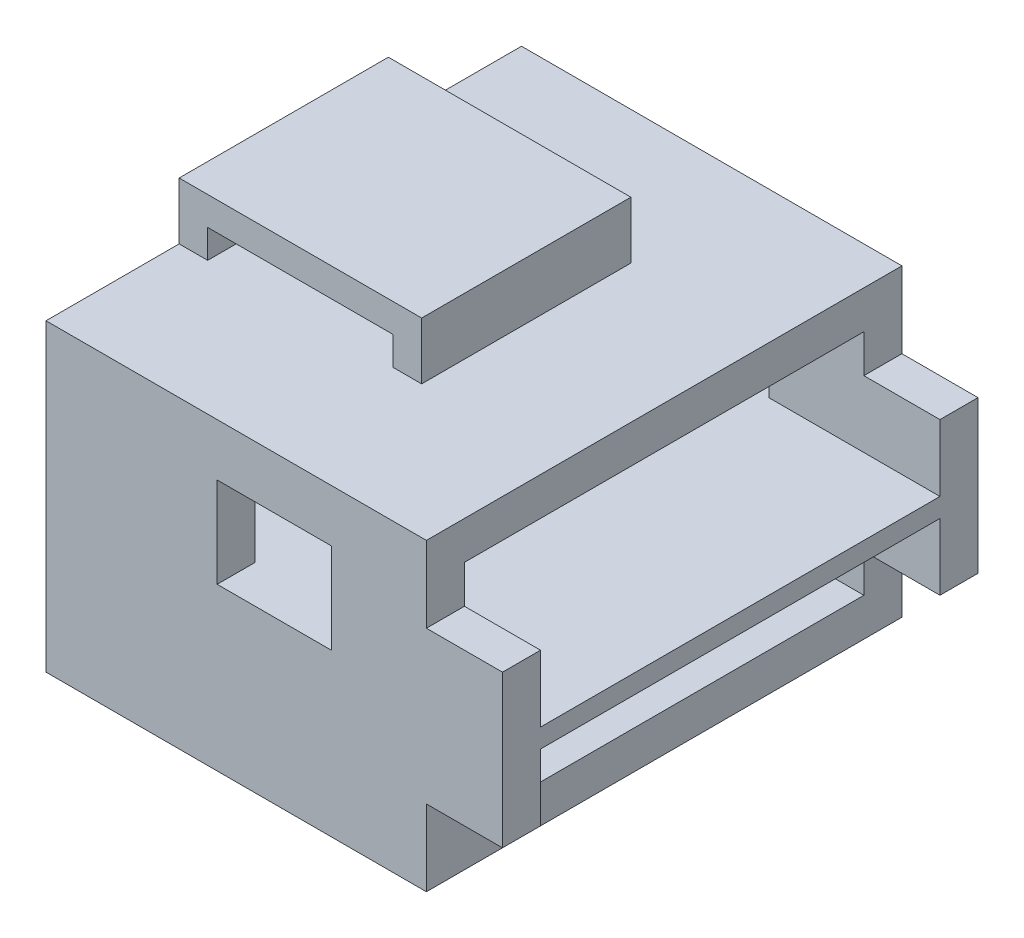
ISO-10303-21;
HEADER;
FILE_DESCRIPTION(('STEP AP214'),'2;1');
FILE_NAME('part.step','',(''),(''),'','','');
FILE_SCHEMA(('AUTOMOTIVE_DESIGN { 1 0 10303 214 1 1 1 1 }'));
ENDSEC;
DATA;
#1=APPLICATION_CONTEXT('core data for automotive mechanical design processes');
#2=APPLICATION_PROTOCOL_DEFINITION('international standard','automotive_design',2000,#1);
#3=PRODUCT_CONTEXT('',#1,'mechanical');
#4=PRODUCT('Part','Part','',(#3));
#5=PRODUCT_RELATED_PRODUCT_CATEGORY('part','',(#4));
#6=PRODUCT_DEFINITION_FORMATION('','',#4);
#7=PRODUCT_DEFINITION_CONTEXT('part definition',#1,'design');
#8=PRODUCT_DEFINITION('design','',#6,#7);
#9=PRODUCT_DEFINITION_SHAPE('','',#8);
#10=(LENGTH_UNIT() NAMED_UNIT(*) SI_UNIT(.MILLI.,.METRE.));
#11=(NAMED_UNIT(*) PLANE_ANGLE_UNIT() SI_UNIT($,.RADIAN.));
#12=(NAMED_UNIT(*) SI_UNIT($,.STERADIAN.) SOLID_ANGLE_UNIT());
#13=UNCERTAINTY_MEASURE_WITH_UNIT(LENGTH_MEASURE(1.E-05),#10,'distance_accuracy_value','');
#14=(GEOMETRIC_REPRESENTATION_CONTEXT(3) GLOBAL_UNCERTAINTY_ASSIGNED_CONTEXT((#13)) GLOBAL_UNIT_ASSIGNED_CONTEXT((#10,
#11,#12)) REPRESENTATION_CONTEXT('',''));
#15=CARTESIAN_POINT('',(0.,0.,0.));
#16=DIRECTION('',(0.,0.,1.));
#17=DIRECTION('',(1.,0.,0.));
#18=AXIS2_PLACEMENT_3D('',#15,#16,#17);
#19=CARTESIAN_POINT('',(0.,16.,0.));
#20=DIRECTION('',(0.,1.,0.));
#21=DIRECTION('',(0.,0.,1.));
#22=AXIS2_PLACEMENT_3D('',#19,#20,#21);
#23=PLANE('',#22);
#24=DIRECTION('',(-1.,0.,0.));
#25=VECTOR('',#24,1.);
#26=CARTESIAN_POINT('',(0.,16.,5.5));
#27=LINE('',#26,#25);
#28=CARTESIAN_POINT('',(2.75,16.,5.5));
#29=VERTEX_POINT('',#28);
#30=CARTESIAN_POINT('',(1.25,16.,5.5));
#31=VERTEX_POINT('',#30);
#32=EDGE_CURVE('E500',#29,#31,#27,.T.);
#33=ORIENTED_EDGE('',*,*,#32,.T.);
#34=DIRECTION('',(0.,0.,1.));
#35=VECTOR('',#34,1.);
#36=CARTESIAN_POINT('',(1.25,16.,-11.5));
#37=LINE('',#36,#35);
#38=CARTESIAN_POINT('',(1.25,16.,-5.5));
#39=VERTEX_POINT('',#38);
#40=EDGE_CURVE('E479',#39,#31,#37,.T.);
#41=ORIENTED_EDGE('',*,*,#40,.F.);
#42=DIRECTION('',(1.,0.,0.));
#43=VECTOR('',#42,1.);
#44=CARTESIAN_POINT('',(0.,16.,-5.5));
#45=LINE('',#44,#43);
#46=CARTESIAN_POINT('',(2.75,16.,-5.5));
#47=VERTEX_POINT('',#46);
#48=EDGE_CURVE('E495',#39,#47,#45,.T.);
#49=ORIENTED_EDGE('',*,*,#48,.T.);
#50=DIRECTION('',(0.,0.,1.));
#51=VECTOR('',#50,1.);
#52=CARTESIAN_POINT('',(2.75,16.,0.));
#53=LINE('',#52,#51);
#54=EDGE_CURVE('E513',#47,#29,#53,.T.);
#55=ORIENTED_EDGE('',*,*,#54,.T.);
#56=EDGE_LOOP('',(#33,#41,#49,#55));
#57=FACE_BOUND('',#56,.T.);
#58=CARTESIAN_POINT('',(-10.,16.,-5.5));
#59=VERTEX_POINT('',#58);
#60=CARTESIAN_POINT('',(-8.5,16.,-5.5));
#61=VERTEX_POINT('',#60);
#62=EDGE_CURVE('E510',#59,#61,#45,.T.);
#63=ORIENTED_EDGE('',*,*,#62,.T.);
#64=DIRECTION('',(0.,0.,1.));
#65=VECTOR('',#64,1.);
#66=CARTESIAN_POINT('',(-8.5,16.,-11.5));
#67=LINE('',#66,#65);
#68=CARTESIAN_POINT('',(-8.5,16.,5.5));
#69=VERTEX_POINT('',#68);
#70=EDGE_CURVE('E482',#61,#69,#67,.T.);
#71=ORIENTED_EDGE('',*,*,#70,.T.);
#72=CARTESIAN_POINT('',(-10.,16.,5.5));
#73=VERTEX_POINT('',#72);
#74=EDGE_CURVE('E516',#69,#73,#27,.T.);
#75=ORIENTED_EDGE('',*,*,#74,.T.);
#76=DIRECTION('',(0.,0.,1.));
#77=VECTOR('',#76,1.);
#78=CARTESIAN_POINT('',(-10.,16.,-12.5));
#79=LINE('',#78,#77);
#80=CARTESIAN_POINT('',(-10.,16.,12.5));
#81=VERTEX_POINT('',#80);
#82=EDGE_CURVE('E364',#73,#81,#79,.T.);
#83=ORIENTED_EDGE('',*,*,#82,.T.);
#84=DIRECTION('',(1.,0.,0.));
#85=VECTOR('',#84,1.);
#86=CARTESIAN_POINT('',(-10.,16.,12.5));
#87=LINE('',#86,#85);
#88=CARTESIAN_POINT('',(10.,16.,12.5));
#89=VERTEX_POINT('',#88);
#90=EDGE_CURVE('E368',#81,#89,#87,.T.);
#91=ORIENTED_EDGE('',*,*,#90,.T.);
#92=DIRECTION('',(0.,0.,-1.));
#93=VECTOR('',#92,1.);
#94=CARTESIAN_POINT('',(10.,16.,-12.5));
#95=LINE('',#94,#93);
#96=CARTESIAN_POINT('',(10.,16.,-12.5));
#97=VERTEX_POINT('',#96);
#98=EDGE_CURVE('E358',#89,#97,#95,.T.);
#99=ORIENTED_EDGE('',*,*,#98,.T.);
#100=DIRECTION('',(-1.,0.,0.));
#101=VECTOR('',#100,1.);
#102=CARTESIAN_POINT('',(-10.,16.,-12.5));
#103=LINE('',#102,#101);
#104=CARTESIAN_POINT('',(-10.,16.,-12.5));
#105=VERTEX_POINT('',#104);
#106=EDGE_CURVE('E361',#97,#105,#103,.T.);
#107=ORIENTED_EDGE('',*,*,#106,.T.);
#108=EDGE_CURVE('E365',#105,#59,#79,.T.);
#109=ORIENTED_EDGE('',*,*,#108,.T.);
#110=EDGE_LOOP('',(#63,#71,#75,#83,#91,#99,#107,#109));
#111=FACE_BOUND('',#110,.T.);
#112=ADVANCED_FACE('F39',(#57,#111),#23,.T.);
#113=CARTESIAN_POINT('',(10.,16.,-12.5));
#114=DIRECTION('',(-1.,0.,0.));
#115=DIRECTION('',(0.,0.,1.));
#116=AXIS2_PLACEMENT_3D('',#113,#114,#115);
#117=PLANE('',#116);
#118=DIRECTION('',(0.,0.,1.));
#119=VECTOR('',#118,1.);
#120=CARTESIAN_POINT('',(10.,12.,-12.5));
#121=LINE('',#120,#119);
#122=CARTESIAN_POINT('',(10.,12.,-12.5));
#123=VERTEX_POINT('',#122);
#124=CARTESIAN_POINT('',(10.,12.,-10.5));
#125=VERTEX_POINT('',#124);
#126=EDGE_CURVE('E521',#123,#125,#121,.T.);
#127=ORIENTED_EDGE('',*,*,#126,.F.);
#128=DIRECTION('',(0.,-1.,0.));
#129=VECTOR('',#128,1.);
#130=CARTESIAN_POINT('',(10.,16.,-12.5));
#131=LINE('',#130,#129);
#132=EDGE_CURVE('E389',#97,#123,#131,.T.);
#133=ORIENTED_EDGE('',*,*,#132,.F.);
#134=ORIENTED_EDGE('',*,*,#98,.F.);
#135=DIRECTION('',(0.,-1.,0.));
#136=VECTOR('',#135,1.);
#137=CARTESIAN_POINT('',(10.,16.,12.5));
#138=LINE('',#137,#136);
#139=CARTESIAN_POINT('',(10.,12.,12.5));
#140=VERTEX_POINT('',#139);
#141=EDGE_CURVE('E379',#89,#140,#138,.T.);
#142=ORIENTED_EDGE('',*,*,#141,.T.);
#143=DIRECTION('',(0.,0.,1.));
#144=VECTOR('',#143,1.);
#145=CARTESIAN_POINT('',(10.,12.,-12.5));
#146=LINE('',#145,#144);
#147=CARTESIAN_POINT('',(10.,12.,10.5));
#148=VERTEX_POINT('',#147);
#149=EDGE_CURVE('E552',#148,#140,#146,.T.);
#150=ORIENTED_EDGE('',*,*,#149,.F.);
#151=DIRECTION('',(0.,-1.,0.));
#152=VECTOR('',#151,1.);
#153=CARTESIAN_POINT('',(10.,16.,10.5));
#154=LINE('',#153,#152);
#155=CARTESIAN_POINT('',(10.,14.,10.5));
#156=VERTEX_POINT('',#155);
#157=EDGE_CURVE('E319',#156,#148,#154,.T.);
#158=ORIENTED_EDGE('',*,*,#157,.F.);
#159=DIRECTION('',(0.,0.,1.));
#160=VECTOR('',#159,1.);
#161=CARTESIAN_POINT('',(10.,14.,-12.5));
#162=LINE('',#161,#160);
#163=CARTESIAN_POINT('',(10.,14.,-10.5));
#164=VERTEX_POINT('',#163);
#165=EDGE_CURVE('E345',#164,#156,#162,.T.);
#166=ORIENTED_EDGE('',*,*,#165,.F.);
#167=DIRECTION('',(0.,1.,0.));
#168=VECTOR('',#167,1.);
#169=CARTESIAN_POINT('',(10.,16.,-10.5));
#170=LINE('',#169,#168);
#171=EDGE_CURVE('E341',#125,#164,#170,.T.);
#172=ORIENTED_EDGE('',*,*,#171,.F.);
#173=EDGE_LOOP('',(#127,#133,#134,#142,#150,#158,#166,#172));
#174=FACE_BOUND('',#173,.T.);
#175=ADVANCED_FACE('F41',(#174),#117,.F.);
#176=DIRECTION('',(0.,0.,-1.));
#177=VECTOR('',#176,1.);
#178=CARTESIAN_POINT('',(10.,4.,-12.5));
#179=LINE('',#178,#177);
#180=CARTESIAN_POINT('',(10.,4.,-10.5));
#181=VERTEX_POINT('',#180);
#182=CARTESIAN_POINT('',(10.,4.,-12.5));
#183=VERTEX_POINT('',#182);
#184=EDGE_CURVE('E533',#181,#183,#179,.T.);
#185=ORIENTED_EDGE('',*,*,#184,.F.);
#186=CARTESIAN_POINT('',(10.,2.,-10.5));
#187=VERTEX_POINT('',#186);
#188=EDGE_CURVE('E342',#187,#181,#170,.T.);
#189=ORIENTED_EDGE('',*,*,#188,.F.);
#190=DIRECTION('',(0.,0.,-1.));
#191=VECTOR('',#190,1.);
#192=CARTESIAN_POINT('',(10.,2.,-12.5));
#193=LINE('',#192,#191);
#194=CARTESIAN_POINT('',(10.,2.,10.5));
#195=VERTEX_POINT('',#194);
#196=EDGE_CURVE('E339',#195,#187,#193,.T.);
#197=ORIENTED_EDGE('',*,*,#196,.F.);
#198=CARTESIAN_POINT('',(10.,4.,10.5));
#199=VERTEX_POINT('',#198);
#200=EDGE_CURVE('E324',#199,#195,#154,.T.);
#201=ORIENTED_EDGE('',*,*,#200,.F.);
#202=DIRECTION('',(0.,0.,-1.));
#203=VECTOR('',#202,1.);
#204=CARTESIAN_POINT('',(10.,4.,-12.5));
#205=LINE('',#204,#203);
#206=CARTESIAN_POINT('',(10.,4.,12.5));
#207=VERTEX_POINT('',#206);
#208=EDGE_CURVE('E564',#207,#199,#205,.T.);
#209=ORIENTED_EDGE('',*,*,#208,.F.);
#210=CARTESIAN_POINT('',(10.,0.,12.5));
#211=VERTEX_POINT('',#210);
#212=EDGE_CURVE('E370',#207,#211,#138,.T.);
#213=ORIENTED_EDGE('',*,*,#212,.T.);
#214=DIRECTION('',(0.,0.,-1.));
#215=VECTOR('',#214,1.);
#216=CARTESIAN_POINT('',(10.,0.,-12.5));
#217=LINE('',#216,#215);
#218=CARTESIAN_POINT('',(10.,0.,-12.5));
#219=VERTEX_POINT('',#218);
#220=EDGE_CURVE('E351',#211,#219,#217,.T.);
#221=ORIENTED_EDGE('',*,*,#220,.T.);
#222=EDGE_CURVE('E388',#183,#219,#131,.T.);
#223=ORIENTED_EDGE('',*,*,#222,.F.);
#224=EDGE_LOOP('',(#185,#189,#197,#201,#209,#213,#221,#223));
#225=FACE_BOUND('',#224,.T.);
#226=ADVANCED_FACE('F664',(#225),#117,.F.);
#227=CARTESIAN_POINT('',(-7.99999999999999,16.,10.5));
#228=DIRECTION('',(0.,0.,1.));
#229=DIRECTION('',(0.,-1.,0.));
#230=AXIS2_PLACEMENT_3D('',#227,#228,#229);
#231=PLANE('',#230);
#232=DIRECTION('',(0.,-1.,0.));
#233=VECTOR('',#232,1.);
#234=CARTESIAN_POINT('',(-7.99999999999999,16.,10.5));
#235=LINE('',#234,#233);
#236=CARTESIAN_POINT('',(-7.99999999999999,7.5,10.5));
#237=VERTEX_POINT('',#236);
#238=CARTESIAN_POINT('',(-7.99999999999999,2.,10.5));
#239=VERTEX_POINT('',#238);
#240=EDGE_CURVE('E335',#237,#239,#235,.T.);
#241=ORIENTED_EDGE('',*,*,#240,.F.);
#242=DIRECTION('',(-1.,0.,0.));
#243=VECTOR('',#242,1.);
#244=CARTESIAN_POINT('',(14.,7.5,10.5));
#245=LINE('',#244,#243);
#246=CARTESIAN_POINT('',(14.,7.5,10.5));
#247=VERTEX_POINT('',#246);
#248=EDGE_CURVE('E581',#247,#237,#245,.T.);
#249=ORIENTED_EDGE('',*,*,#248,.F.);
#250=DIRECTION('',(0.,1.,0.));
#251=VECTOR('',#250,1.);
#252=CARTESIAN_POINT('',(14.,16.,10.5));
#253=LINE('',#252,#251);
#254=CARTESIAN_POINT('',(14.,4.,10.5));
#255=VERTEX_POINT('',#254);
#256=EDGE_CURVE('E553',#255,#247,#253,.T.);
#257=ORIENTED_EDGE('',*,*,#256,.F.);
#258=DIRECTION('',(-1.,0.,0.));
#259=VECTOR('',#258,1.);
#260=CARTESIAN_POINT('',(14.,4.,10.5));
#261=LINE('',#260,#259);
#262=EDGE_CURVE('E562',#255,#199,#261,.T.);
#263=ORIENTED_EDGE('',*,*,#262,.T.);
#264=ORIENTED_EDGE('',*,*,#200,.T.);
#265=DIRECTION('',(1.,0.,0.));
#266=VECTOR('',#265,1.);
#267=CARTESIAN_POINT('',(-7.99999999999999,2.,10.5));
#268=LINE('',#267,#266);
#269=EDGE_CURVE('E348',#239,#195,#268,.T.);
#270=ORIENTED_EDGE('',*,*,#269,.F.);
#271=EDGE_LOOP('',(#241,#249,#257,#263,#264,#270));
#272=FACE_BOUND('',#271,.T.);
#273=ADVANCED_FACE('F690',(#272),#231,.F.);
#274=DIRECTION('',(-1.,0.,0.));
#275=VECTOR('',#274,1.);
#276=CARTESIAN_POINT('',(14.,8.5,10.5));
#277=LINE('',#276,#275);
#278=CARTESIAN_POINT('',(14.,8.5,10.5));
#279=VERTEX_POINT('',#278);
#280=CARTESIAN_POINT('',(5.,8.5,10.5));
#281=VERTEX_POINT('',#280);
#282=EDGE_CURVE('E584',#279,#281,#277,.T.);
#283=ORIENTED_EDGE('',*,*,#282,.T.);
#284=DIRECTION('',(0.,1.,0.));
#285=VECTOR('',#284,1.);
#286=CARTESIAN_POINT('',(5.,16.,10.5));
#287=LINE('',#286,#285);
#288=CARTESIAN_POINT('',(5.,13.25,10.5));
#289=VERTEX_POINT('',#288);
#290=EDGE_CURVE('E463',#281,#289,#287,.T.);
#291=ORIENTED_EDGE('',*,*,#290,.T.);
#292=DIRECTION('',(-1.,0.,0.));
#293=VECTOR('',#292,1.);
#294=CARTESIAN_POINT('',(-7.99999999999999,13.25,10.5));
#295=LINE('',#294,#293);
#296=CARTESIAN_POINT('',(-0.999999999999997,13.25,10.5));
#297=VERTEX_POINT('',#296);
#298=EDGE_CURVE('E472',#289,#297,#295,.T.);
#299=ORIENTED_EDGE('',*,*,#298,.T.);
#300=DIRECTION('',(0.,-1.,0.));
#301=VECTOR('',#300,1.);
#302=CARTESIAN_POINT('',(-0.999999999999997,16.,10.5));
#303=LINE('',#302,#301);
#304=CARTESIAN_POINT('',(-0.999999999999997,8.5,10.5));
#305=VERTEX_POINT('',#304);
#306=EDGE_CURVE('E451',#297,#305,#303,.T.);
#307=ORIENTED_EDGE('',*,*,#306,.T.);
#308=CARTESIAN_POINT('',(-7.99999999999999,8.5,10.5));
#309=VERTEX_POINT('',#308);
#310=EDGE_CURVE('E583',#305,#309,#277,.T.);
#311=ORIENTED_EDGE('',*,*,#310,.T.);
#312=CARTESIAN_POINT('',(-7.99999999999999,14.,10.5));
#313=VERTEX_POINT('',#312);
#314=EDGE_CURVE('E336',#313,#309,#235,.T.);
#315=ORIENTED_EDGE('',*,*,#314,.F.);
#316=DIRECTION('',(1.,0.,0.));
#317=VECTOR('',#316,1.);
#318=CARTESIAN_POINT('',(-7.99999999999999,14.,10.5));
#319=LINE('',#318,#317);
#320=EDGE_CURVE('E352',#313,#156,#319,.T.);
#321=ORIENTED_EDGE('',*,*,#320,.T.);
#322=ORIENTED_EDGE('',*,*,#157,.T.);
#323=DIRECTION('',(-1.,0.,0.));
#324=VECTOR('',#323,1.);
#325=CARTESIAN_POINT('',(14.,12.,10.5));
#326=LINE('',#325,#324);
#327=CARTESIAN_POINT('',(14.,12.,10.5));
#328=VERTEX_POINT('',#327);
#329=EDGE_CURVE('E573',#328,#148,#326,.T.);
#330=ORIENTED_EDGE('',*,*,#329,.F.);
#331=EDGE_CURVE('E556',#279,#328,#253,.T.);
#332=ORIENTED_EDGE('',*,*,#331,.F.);
#333=EDGE_LOOP('',(#283,#291,#299,#307,#311,#315,#321,#322,#330,#332));
#334=FACE_BOUND('',#333,.T.);
#335=ADVANCED_FACE('F612',(#334),#231,.F.);
#336=CARTESIAN_POINT('',(-8.,16.,-10.5));
#337=DIRECTION('',(0.,0.,-1.));
#338=DIRECTION('',(0.,1.,0.));
#339=AXIS2_PLACEMENT_3D('',#336,#337,#338);
#340=PLANE('',#339);
#341=DIRECTION('',(-1.,0.,0.));
#342=VECTOR('',#341,1.);
#343=CARTESIAN_POINT('',(14.,7.5,-10.5));
#344=LINE('',#343,#342);
#345=CARTESIAN_POINT('',(14.,7.5,-10.5));
#346=VERTEX_POINT('',#345);
#347=CARTESIAN_POINT('',(-8.,7.5,-10.5));
#348=VERTEX_POINT('',#347);
#349=EDGE_CURVE('E328',#346,#348,#344,.T.);
#350=ORIENTED_EDGE('',*,*,#349,.T.);
#351=DIRECTION('',(0.,1.,0.));
#352=VECTOR('',#351,1.);
#353=CARTESIAN_POINT('',(-8.,16.,-10.5));
#354=LINE('',#353,#352);
#355=CARTESIAN_POINT('',(-8.,2.,-10.5));
#356=VERTEX_POINT('',#355);
#357=EDGE_CURVE('E330',#356,#348,#354,.T.);
#358=ORIENTED_EDGE('',*,*,#357,.F.);
#359=DIRECTION('',(1.,0.,0.));
#360=VECTOR('',#359,1.);
#361=CARTESIAN_POINT('',(-8.,2.,-10.5));
#362=LINE('',#361,#360);
#363=EDGE_CURVE('E316',#356,#187,#362,.T.);
#364=ORIENTED_EDGE('',*,*,#363,.T.);
#365=ORIENTED_EDGE('',*,*,#188,.T.);
#366=DIRECTION('',(-1.,0.,0.));
#367=VECTOR('',#366,1.);
#368=CARTESIAN_POINT('',(14.,4.,-10.5));
#369=LINE('',#368,#367);
#370=CARTESIAN_POINT('',(14.,4.,-10.5));
#371=VERTEX_POINT('',#370);
#372=EDGE_CURVE('E545',#371,#181,#369,.T.);
#373=ORIENTED_EDGE('',*,*,#372,.F.);
#374=DIRECTION('',(0.,-1.,0.));
#375=VECTOR('',#374,1.);
#376=CARTESIAN_POINT('',(14.,16.,-10.5));
#377=LINE('',#376,#375);
#378=EDGE_CURVE('E535',#346,#371,#377,.T.);
#379=ORIENTED_EDGE('',*,*,#378,.F.);
#380=EDGE_LOOP('',(#350,#358,#364,#365,#373,#379));
#381=FACE_BOUND('',#380,.T.);
#382=ADVANCED_FACE('F695',(#381),#340,.F.);
#383=DIRECTION('',(1.,0.,0.));
#384=VECTOR('',#383,1.);
#385=CARTESIAN_POINT('',(-8.,13.25,-10.5));
#386=LINE('',#385,#384);
#387=CARTESIAN_POINT('',(-0.999999999999997,13.25,-10.5));
#388=VERTEX_POINT('',#387);
#389=CARTESIAN_POINT('',(5.,13.25,-10.5));
#390=VERTEX_POINT('',#389);
#391=EDGE_CURVE('E469',#388,#390,#386,.T.);
#392=ORIENTED_EDGE('',*,*,#391,.T.);
#393=DIRECTION('',(0.,-1.,0.));
#394=VECTOR('',#393,1.);
#395=CARTESIAN_POINT('',(5.,16.,-10.5));
#396=LINE('',#395,#394);
#397=CARTESIAN_POINT('',(5.,8.5,-10.5));
#398=VERTEX_POINT('',#397);
#399=EDGE_CURVE('E460',#390,#398,#396,.T.);
#400=ORIENTED_EDGE('',*,*,#399,.T.);
#401=DIRECTION('',(-1.,0.,0.));
#402=VECTOR('',#401,1.);
#403=CARTESIAN_POINT('',(14.,8.5,-10.5));
#404=LINE('',#403,#402);
#405=CARTESIAN_POINT('',(14.,8.5,-10.5));
#406=VERTEX_POINT('',#405);
#407=EDGE_CURVE('E587',#406,#398,#404,.T.);
#408=ORIENTED_EDGE('',*,*,#407,.F.);
#409=CARTESIAN_POINT('',(14.,12.,-10.5));
#410=VERTEX_POINT('',#409);
#411=EDGE_CURVE('E536',#410,#406,#377,.T.);
#412=ORIENTED_EDGE('',*,*,#411,.F.);
#413=DIRECTION('',(-1.,0.,0.));
#414=VECTOR('',#413,1.);
#415=CARTESIAN_POINT('',(14.,12.,-10.5));
#416=LINE('',#415,#414);
#417=EDGE_CURVE('E547',#410,#125,#416,.T.);
#418=ORIENTED_EDGE('',*,*,#417,.T.);
#419=ORIENTED_EDGE('',*,*,#171,.T.);
#420=DIRECTION('',(1.,0.,0.));
#421=VECTOR('',#420,1.);
#422=CARTESIAN_POINT('',(-8.,14.,-10.5));
#423=LINE('',#422,#421);
#424=CARTESIAN_POINT('',(-8.,14.,-10.5));
#425=VERTEX_POINT('',#424);
#426=EDGE_CURVE('E354',#425,#164,#423,.T.);
#427=ORIENTED_EDGE('',*,*,#426,.F.);
#428=CARTESIAN_POINT('',(-8.,8.5,-10.5));
#429=VERTEX_POINT('',#428);
#430=EDGE_CURVE('E322',#429,#425,#354,.T.);
#431=ORIENTED_EDGE('',*,*,#430,.F.);
#432=CARTESIAN_POINT('',(-0.999999999999997,8.5,-10.5));
#433=VERTEX_POINT('',#432);
#434=EDGE_CURVE('E586',#433,#429,#404,.T.);
#435=ORIENTED_EDGE('',*,*,#434,.F.);
#436=DIRECTION('',(0.,1.,0.));
#437=VECTOR('',#436,1.);
#438=CARTESIAN_POINT('',(-0.999999999999997,16.,-10.5));
#439=LINE('',#438,#437);
#440=EDGE_CURVE('E448',#433,#388,#439,.T.);
#441=ORIENTED_EDGE('',*,*,#440,.T.);
#442=EDGE_LOOP('',(#392,#400,#408,#412,#418,#419,#427,#431,#435,#441));
#443=FACE_BOUND('',#442,.T.);
#444=ADVANCED_FACE('F605',(#443),#340,.F.);
#445=CARTESIAN_POINT('',(-8.,0.,0.));
#446=DIRECTION('',(1.,0.,0.));
#447=DIRECTION('',(0.,0.,-1.));
#448=AXIS2_PLACEMENT_3D('',#445,#446,#447);
#449=PLANE('',#448);
#450=DIRECTION('',(0.,-1.,0.));
#451=VECTOR('',#450,1.);
#452=CARTESIAN_POINT('',(-8.,0.,3.));
#453=LINE('',#452,#451);
#454=CARTESIAN_POINT('',(-8.,6.75,3.));
#455=VERTEX_POINT('',#454);
#456=CARTESIAN_POINT('',(-8.,2.,3.));
#457=VERTEX_POINT('',#456);
#458=EDGE_CURVE('E418',#455,#457,#453,.T.);
#459=ORIENTED_EDGE('',*,*,#458,.F.);
#460=DIRECTION('',(0.,0.,1.));
#461=VECTOR('',#460,1.);
#462=CARTESIAN_POINT('',(-8.,6.75,0.));
#463=LINE('',#462,#461);
#464=CARTESIAN_POINT('',(-8.,6.75,-3.));
#465=VERTEX_POINT('',#464);
#466=EDGE_CURVE('E311',#465,#455,#463,.T.);
#467=ORIENTED_EDGE('',*,*,#466,.F.);
#468=DIRECTION('',(0.,1.,0.));
#469=VECTOR('',#468,1.);
#470=CARTESIAN_POINT('',(-8.,0.,-3.));
#471=LINE('',#470,#469);
#472=CARTESIAN_POINT('',(-8.,2.,-3.));
#473=VERTEX_POINT('',#472);
#474=EDGE_CURVE('E297',#473,#465,#471,.T.);
#475=ORIENTED_EDGE('',*,*,#474,.F.);
#476=DIRECTION('',(0.,0.,-1.));
#477=VECTOR('',#476,1.);
#478=CARTESIAN_POINT('',(-8.,2.,-12.5));
#479=LINE('',#478,#477);
#480=EDGE_CURVE('E309',#473,#356,#479,.T.);
#481=ORIENTED_EDGE('',*,*,#480,.T.);
#482=ORIENTED_EDGE('',*,*,#357,.T.);
#483=DIRECTION('',(0.,0.,1.));
#484=VECTOR('',#483,1.);
#485=CARTESIAN_POINT('',(-8.,7.5,0.));
#486=LINE('',#485,#484);
#487=EDGE_CURVE('E395',#348,#237,#486,.T.);
#488=ORIENTED_EDGE('',*,*,#487,.T.);
#489=ORIENTED_EDGE('',*,*,#240,.T.);
#490=EDGE_CURVE('E318',#239,#457,#479,.T.);
#491=ORIENTED_EDGE('',*,*,#490,.T.);
#492=EDGE_LOOP('',(#459,#467,#475,#481,#482,#488,#489,#491));
#493=FACE_BOUND('',#492,.T.);
#494=ADVANCED_FACE('F307',(#493),#449,.T.);
#495=ORIENTED_EDGE('',*,*,#314,.T.);
#496=DIRECTION('',(0.,0.,-1.));
#497=VECTOR('',#496,1.);
#498=CARTESIAN_POINT('',(-8.,8.5,0.));
#499=LINE('',#498,#497);
#500=EDGE_CURVE('E392',#309,#429,#499,.T.);
#501=ORIENTED_EDGE('',*,*,#500,.T.);
#502=ORIENTED_EDGE('',*,*,#430,.T.);
#503=DIRECTION('',(0.,0.,1.));
#504=VECTOR('',#503,1.);
#505=CARTESIAN_POINT('',(-8.,14.,-12.5));
#506=LINE('',#505,#504);
#507=EDGE_CURVE('E332',#425,#313,#506,.T.);
#508=ORIENTED_EDGE('',*,*,#507,.T.);
#509=EDGE_LOOP('',(#495,#501,#502,#508));
#510=FACE_BOUND('',#509,.T.);
#511=ADVANCED_FACE('F602',(#510),#449,.T.);
#512=CARTESIAN_POINT('',(-10.,16.,-12.5));
#513=DIRECTION('',(0.,0.,1.));
#514=DIRECTION('',(1.,0.,0.));
#515=AXIS2_PLACEMENT_3D('',#512,#513,#514);
#516=PLANE('',#515);
#517=DIRECTION('',(1.,0.,0.));
#518=VECTOR('',#517,1.);
#519=CARTESIAN_POINT('',(-10.,8.5,-12.5));
#520=LINE('',#519,#518);
#521=CARTESIAN_POINT('',(-0.999999999999997,8.5,-12.5));
#522=VERTEX_POINT('',#521);
#523=CARTESIAN_POINT('',(5.,8.5,-12.5));
#524=VERTEX_POINT('',#523);
#525=EDGE_CURVE('E475',#522,#524,#520,.T.);
#526=ORIENTED_EDGE('',*,*,#525,.T.);
#527=DIRECTION('',(0.,1.,0.));
#528=VECTOR('',#527,1.);
#529=CARTESIAN_POINT('',(5.,16.,-12.5));
#530=LINE('',#529,#528);
#531=CARTESIAN_POINT('',(5.,13.25,-12.5));
#532=VERTEX_POINT('',#531);
#533=EDGE_CURVE('E457',#524,#532,#530,.T.);
#534=ORIENTED_EDGE('',*,*,#533,.T.);
#535=DIRECTION('',(-1.,0.,0.));
#536=VECTOR('',#535,1.);
#537=CARTESIAN_POINT('',(-10.,13.25,-12.5));
#538=LINE('',#537,#536);
#539=CARTESIAN_POINT('',(-0.999999999999997,13.25,-12.5));
#540=VERTEX_POINT('',#539);
#541=EDGE_CURVE('E466',#532,#540,#538,.T.);
#542=ORIENTED_EDGE('',*,*,#541,.T.);
#543=DIRECTION('',(0.,-1.,0.));
#544=VECTOR('',#543,1.);
#545=CARTESIAN_POINT('',(-0.999999999999997,16.,-12.5));
#546=LINE('',#545,#544);
#547=EDGE_CURVE('E445',#540,#522,#546,.T.);
#548=ORIENTED_EDGE('',*,*,#547,.T.);
#549=EDGE_LOOP('',(#526,#534,#542,#548));
#550=FACE_BOUND('',#549,.T.);
#551=DIRECTION('',(-1.,0.,0.));
#552=VECTOR('',#551,1.);
#553=CARTESIAN_POINT('',(-10.,0.,-12.5));
#554=LINE('',#553,#552);
#555=CARTESIAN_POINT('',(-10.,0.,-12.5));
#556=VERTEX_POINT('',#555);
#557=EDGE_CURVE('E373',#219,#556,#554,.T.);
#558=ORIENTED_EDGE('',*,*,#557,.T.);
#559=DIRECTION('',(0.,-1.,0.));
#560=VECTOR('',#559,1.);
#561=CARTESIAN_POINT('',(-10.,16.,-12.5));
#562=LINE('',#561,#560);
#563=EDGE_CURVE('E385',#105,#556,#562,.T.);
#564=ORIENTED_EDGE('',*,*,#563,.F.);
#565=ORIENTED_EDGE('',*,*,#106,.F.);
#566=ORIENTED_EDGE('',*,*,#132,.T.);
#567=DIRECTION('',(-1.,0.,0.));
#568=VECTOR('',#567,1.);
#569=CARTESIAN_POINT('',(14.,12.,-12.5));
#570=LINE('',#569,#568);
#571=CARTESIAN_POINT('',(14.,12.,-12.5));
#572=VERTEX_POINT('',#571);
#573=EDGE_CURVE('E550',#572,#123,#570,.T.);
#574=ORIENTED_EDGE('',*,*,#573,.F.);
#575=DIRECTION('',(0.,1.,0.));
#576=VECTOR('',#575,1.);
#577=CARTESIAN_POINT('',(14.,16.,-12.5));
#578=LINE('',#577,#576);
#579=CARTESIAN_POINT('',(14.,4.,-12.5));
#580=VERTEX_POINT('',#579);
#581=EDGE_CURVE('E529',#580,#572,#578,.T.);
#582=ORIENTED_EDGE('',*,*,#581,.F.);
#583=DIRECTION('',(-1.,0.,0.));
#584=VECTOR('',#583,1.);
#585=CARTESIAN_POINT('',(14.,4.,-12.5));
#586=LINE('',#585,#584);
#587=EDGE_CURVE('E540',#580,#183,#586,.T.);
#588=ORIENTED_EDGE('',*,*,#587,.T.);
#589=ORIENTED_EDGE('',*,*,#222,.T.);
#590=EDGE_LOOP('',(#558,#564,#565,#566,#574,#582,#588,#589));
#591=FACE_BOUND('',#590,.T.);
#592=ADVANCED_FACE('F635',(#550,#591),#516,.F.);
#593=CARTESIAN_POINT('',(-10.,16.,-12.5));
#594=DIRECTION('',(1.,0.,0.));
#595=DIRECTION('',(0.,0.,-1.));
#596=AXIS2_PLACEMENT_3D('',#593,#594,#595);
#597=PLANE('',#596);
#598=DIRECTION('',(0.,0.,1.));
#599=VECTOR('',#598,1.);
#600=CARTESIAN_POINT('',(-10.,6.75,-12.5));
#601=LINE('',#600,#599);
#602=CARTESIAN_POINT('',(-10.,6.75,-3.));
#603=VERTEX_POINT('',#602);
#604=CARTESIAN_POINT('',(-10.,6.75,3.));
#605=VERTEX_POINT('',#604);
#606=EDGE_CURVE('E11',#603,#605,#601,.T.);
#607=ORIENTED_EDGE('',*,*,#606,.T.);
#608=DIRECTION('',(0.,-1.,0.));
#609=VECTOR('',#608,1.);
#610=CARTESIAN_POINT('',(-10.,16.,3.00000000000001));
#611=LINE('',#610,#609);
#612=CARTESIAN_POINT('',(-10.,2.,3.));
#613=VERTEX_POINT('',#612);
#614=EDGE_CURVE('E312',#605,#613,#611,.T.);
#615=ORIENTED_EDGE('',*,*,#614,.T.);
#616=DIRECTION('',(0.,0.,-1.));
#617=VECTOR('',#616,1.);
#618=CARTESIAN_POINT('',(-10.,2.,-12.5));
#619=LINE('',#618,#617);
#620=CARTESIAN_POINT('',(-10.,2.,-3.));
#621=VERTEX_POINT('',#620);
#622=EDGE_CURVE('E47',#613,#621,#619,.T.);
#623=ORIENTED_EDGE('',*,*,#622,.T.);
#624=DIRECTION('',(0.,1.,0.));
#625=VECTOR('',#624,1.);
#626=CARTESIAN_POINT('',(-10.,16.,-2.99999999999999));
#627=LINE('',#626,#625);
#628=EDGE_CURVE('E300',#621,#603,#627,.T.);
#629=ORIENTED_EDGE('',*,*,#628,.T.);
#630=EDGE_LOOP('',(#607,#615,#623,#629));
#631=FACE_BOUND('',#630,.T.);
#632=DIRECTION('',(0.,0.,1.));
#633=VECTOR('',#632,1.);
#634=CARTESIAN_POINT('',(-10.,0.,-12.5));
#635=LINE('',#634,#633);
#636=CARTESIAN_POINT('',(-10.,0.,12.5));
#637=VERTEX_POINT('',#636);
#638=EDGE_CURVE('E375',#556,#637,#635,.T.);
#639=ORIENTED_EDGE('',*,*,#638,.T.);
#640=DIRECTION('',(0.,-1.,0.));
#641=VECTOR('',#640,1.);
#642=CARTESIAN_POINT('',(-10.,16.,12.5));
#643=LINE('',#642,#641);
#644=EDGE_CURVE('E382',#81,#637,#643,.T.);
#645=ORIENTED_EDGE('',*,*,#644,.F.);
#646=ORIENTED_EDGE('',*,*,#82,.F.);
#647=DIRECTION('',(0.,-1.,0.));
#648=VECTOR('',#647,1.);
#649=CARTESIAN_POINT('',(-10.,19.,5.5));
#650=LINE('',#649,#648);
#651=CARTESIAN_POINT('',(-10.,19.,5.5));
#652=VERTEX_POINT('',#651);
#653=EDGE_CURVE('E522',#652,#73,#650,.T.);
#654=ORIENTED_EDGE('',*,*,#653,.F.);
#655=DIRECTION('',(0.,0.,-1.));
#656=VECTOR('',#655,1.);
#657=CARTESIAN_POINT('',(-10.,19.,0.));
#658=LINE('',#657,#656);
#659=CARTESIAN_POINT('',(-10.,19.,-5.5));
#660=VERTEX_POINT('',#659);
#661=EDGE_CURVE('E506',#652,#660,#658,.T.);
#662=ORIENTED_EDGE('',*,*,#661,.T.);
#663=DIRECTION('',(0.,-1.,0.));
#664=VECTOR('',#663,1.);
#665=CARTESIAN_POINT('',(-10.,19.,-5.5));
#666=LINE('',#665,#664);
#667=EDGE_CURVE('E519',#660,#59,#666,.T.);
#668=ORIENTED_EDGE('',*,*,#667,.T.);
#669=ORIENTED_EDGE('',*,*,#108,.F.);
#670=ORIENTED_EDGE('',*,*,#563,.T.);
#671=EDGE_LOOP('',(#639,#645,#646,#654,#662,#668,#669,#670));
#672=FACE_BOUND('',#671,.T.);
#673=ADVANCED_FACE('F412',(#631,#672),#597,.F.);
#674=CARTESIAN_POINT('',(-10.,16.,12.5));
#675=DIRECTION('',(0.,0.,-1.));
#676=DIRECTION('',(-1.,0.,0.));
#677=AXIS2_PLACEMENT_3D('',#674,#675,#676);
#678=PLANE('',#677);
#679=DIRECTION('',(1.,0.,0.));
#680=VECTOR('',#679,1.);
#681=CARTESIAN_POINT('',(-10.,13.25,12.5));
#682=LINE('',#681,#680);
#683=CARTESIAN_POINT('',(-0.999999999999997,13.25,12.5));
#684=VERTEX_POINT('',#683);
#685=CARTESIAN_POINT('',(5.,13.25,12.5));
#686=VERTEX_POINT('',#685);
#687=EDGE_CURVE('E405',#684,#686,#682,.T.);
#688=ORIENTED_EDGE('',*,*,#687,.T.);
#689=DIRECTION('',(0.,-1.,0.));
#690=VECTOR('',#689,1.);
#691=CARTESIAN_POINT('',(5.,16.,12.5));
#692=LINE('',#691,#690);
#693=CARTESIAN_POINT('',(5.,8.5,12.5));
#694=VERTEX_POINT('',#693);
#695=EDGE_CURVE('E454',#686,#694,#692,.T.);
#696=ORIENTED_EDGE('',*,*,#695,.T.);
#697=DIRECTION('',(-1.,0.,0.));
#698=VECTOR('',#697,1.);
#699=CARTESIAN_POINT('',(-10.,8.5,12.5));
#700=LINE('',#699,#698);
#701=CARTESIAN_POINT('',(-0.999999999999997,8.5,12.5));
#702=VERTEX_POINT('',#701);
#703=EDGE_CURVE('E408',#694,#702,#700,.T.);
#704=ORIENTED_EDGE('',*,*,#703,.T.);
#705=DIRECTION('',(0.,1.,0.));
#706=VECTOR('',#705,1.);
#707=CARTESIAN_POINT('',(-0.999999999999997,16.,12.5));
#708=LINE('',#707,#706);
#709=EDGE_CURVE('E442',#702,#684,#708,.T.);
#710=ORIENTED_EDGE('',*,*,#709,.T.);
#711=EDGE_LOOP('',(#688,#696,#704,#710));
#712=FACE_BOUND('',#711,.T.);
#713=DIRECTION('',(1.,0.,0.));
#714=VECTOR('',#713,1.);
#715=CARTESIAN_POINT('',(-10.,0.,12.5));
#716=LINE('',#715,#714);
#717=EDGE_CURVE('E362',#637,#211,#716,.T.);
#718=ORIENTED_EDGE('',*,*,#717,.T.);
#719=ORIENTED_EDGE('',*,*,#212,.F.);
#720=DIRECTION('',(-1.,0.,0.));
#721=VECTOR('',#720,1.);
#722=CARTESIAN_POINT('',(14.,4.,12.5));
#723=LINE('',#722,#721);
#724=CARTESIAN_POINT('',(14.,4.,12.5));
#725=VERTEX_POINT('',#724);
#726=EDGE_CURVE('E568',#725,#207,#723,.T.);
#727=ORIENTED_EDGE('',*,*,#726,.F.);
#728=DIRECTION('',(0.,-1.,0.));
#729=VECTOR('',#728,1.);
#730=CARTESIAN_POINT('',(14.,16.,12.5));
#731=LINE('',#730,#729);
#732=CARTESIAN_POINT('',(14.,12.,12.5));
#733=VERTEX_POINT('',#732);
#734=EDGE_CURVE('E558',#733,#725,#731,.T.);
#735=ORIENTED_EDGE('',*,*,#734,.F.);
#736=DIRECTION('',(-1.,0.,0.));
#737=VECTOR('',#736,1.);
#738=CARTESIAN_POINT('',(14.,12.,12.5));
#739=LINE('',#738,#737);
#740=EDGE_CURVE('E570',#733,#140,#739,.T.);
#741=ORIENTED_EDGE('',*,*,#740,.T.);
#742=ORIENTED_EDGE('',*,*,#141,.F.);
#743=ORIENTED_EDGE('',*,*,#90,.F.);
#744=ORIENTED_EDGE('',*,*,#644,.T.);
#745=EDGE_LOOP('',(#718,#719,#727,#735,#741,#742,#743,#744));
#746=FACE_BOUND('',#745,.T.);
#747=ADVANCED_FACE('F617',(#712,#746),#678,.F.);
#748=CARTESIAN_POINT('',(0.,0.,0.));
#749=DIRECTION('',(0.,1.,0.));
#750=DIRECTION('',(0.,0.,1.));
#751=AXIS2_PLACEMENT_3D('',#748,#749,#750);
#752=PLANE('',#751);
#753=ORIENTED_EDGE('',*,*,#220,.F.);
#754=ORIENTED_EDGE('',*,*,#717,.F.);
#755=ORIENTED_EDGE('',*,*,#638,.F.);
#756=ORIENTED_EDGE('',*,*,#557,.F.);
#757=EDGE_LOOP('',(#753,#754,#755,#756));
#758=FACE_BOUND('',#757,.T.);
#759=ADVANCED_FACE('F670',(#758),#752,.F.);
#760=CARTESIAN_POINT('',(-8.,2.,-12.5));
#761=DIRECTION('',(0.,-1.,0.));
#762=DIRECTION('',(0.,0.,-1.));
#763=AXIS2_PLACEMENT_3D('',#760,#761,#762);
#764=PLANE('',#763);
#765=ORIENTED_EDGE('',*,*,#480,.F.);
#766=DIRECTION('',(1.,0.,0.));
#767=VECTOR('',#766,1.);
#768=CARTESIAN_POINT('',(-33.,2.,-3.));
#769=LINE('',#768,#767);
#770=EDGE_CURVE('E54',#621,#473,#769,.T.);
#771=ORIENTED_EDGE('',*,*,#770,.F.);
#772=ORIENTED_EDGE('',*,*,#622,.F.);
#773=DIRECTION('',(1.,0.,0.));
#774=VECTOR('',#773,1.);
#775=CARTESIAN_POINT('',(-33.,2.,3.));
#776=LINE('',#775,#774);
#777=EDGE_CURVE('E60',#613,#457,#776,.T.);
#778=ORIENTED_EDGE('',*,*,#777,.T.);
#779=ORIENTED_EDGE('',*,*,#490,.F.);
#780=ORIENTED_EDGE('',*,*,#269,.T.);
#781=ORIENTED_EDGE('',*,*,#196,.T.);
#782=ORIENTED_EDGE('',*,*,#363,.F.);
#783=EDGE_LOOP('',(#765,#771,#772,#778,#779,#780,#781,#782));
#784=FACE_BOUND('',#783,.T.);
#785=ADVANCED_FACE('F314',(#784),#764,.F.);
#786=CARTESIAN_POINT('',(-8.,14.,-12.5));
#787=DIRECTION('',(0.,1.,0.));
#788=DIRECTION('',(0.,0.,1.));
#789=AXIS2_PLACEMENT_3D('',#786,#787,#788);
#790=PLANE('',#789);
#791=ORIENTED_EDGE('',*,*,#165,.T.);
#792=ORIENTED_EDGE('',*,*,#320,.F.);
#793=ORIENTED_EDGE('',*,*,#507,.F.);
#794=ORIENTED_EDGE('',*,*,#426,.T.);
#795=EDGE_LOOP('',(#791,#792,#793,#794));
#796=FACE_BOUND('',#795,.T.);
#797=ADVANCED_FACE('F610',(#796),#790,.F.);
#798=CARTESIAN_POINT('',(14.,7.5,-12.5));
#799=DIRECTION('',(0.,1.,0.));
#800=DIRECTION('',(0.,0.,1.));
#801=AXIS2_PLACEMENT_3D('',#798,#799,#800);
#802=PLANE('',#801);
#803=ORIENTED_EDGE('',*,*,#487,.F.);
#804=ORIENTED_EDGE('',*,*,#349,.F.);
#805=DIRECTION('',(0.,0.,-1.));
#806=VECTOR('',#805,1.);
#807=CARTESIAN_POINT('',(14.,7.5,-12.5));
#808=LINE('',#807,#806);
#809=EDGE_CURVE('E575',#247,#346,#808,.T.);
#810=ORIENTED_EDGE('',*,*,#809,.F.);
#811=ORIENTED_EDGE('',*,*,#248,.T.);
#812=EDGE_LOOP('',(#803,#804,#810,#811));
#813=FACE_BOUND('',#812,.T.);
#814=ADVANCED_FACE('F688',(#813),#802,.F.);
#815=CARTESIAN_POINT('',(14.,8.5,-12.5));
#816=DIRECTION('',(0.,-1.,0.));
#817=DIRECTION('',(0.,0.,-1.));
#818=AXIS2_PLACEMENT_3D('',#815,#816,#817);
#819=PLANE('',#818);
#820=ORIENTED_EDGE('',*,*,#310,.F.);
#821=DIRECTION('',(0.,0.,1.));
#822=VECTOR('',#821,1.);
#823=CARTESIAN_POINT('',(-0.999999999999997,8.5,-16.5));
#824=LINE('',#823,#822);
#825=EDGE_CURVE('E433',#305,#702,#824,.T.);
#826=ORIENTED_EDGE('',*,*,#825,.T.);
#827=ORIENTED_EDGE('',*,*,#703,.F.);
#828=DIRECTION('',(0.,0.,1.));
#829=VECTOR('',#828,1.);
#830=CARTESIAN_POINT('',(5.,8.5,-16.5));
#831=LINE('',#830,#829);
#832=EDGE_CURVE('E428',#281,#694,#831,.T.);
#833=ORIENTED_EDGE('',*,*,#832,.F.);
#834=ORIENTED_EDGE('',*,*,#282,.F.);
#835=DIRECTION('',(0.,0.,1.));
#836=VECTOR('',#835,1.);
#837=CARTESIAN_POINT('',(14.,8.5,-12.5));
#838=LINE('',#837,#836);
#839=EDGE_CURVE('E578',#406,#279,#838,.T.);
#840=ORIENTED_EDGE('',*,*,#839,.F.);
#841=ORIENTED_EDGE('',*,*,#407,.T.);
#842=EDGE_CURVE('E431',#524,#398,#831,.T.);
#843=ORIENTED_EDGE('',*,*,#842,.F.);
#844=ORIENTED_EDGE('',*,*,#525,.F.);
#845=EDGE_CURVE('E432',#522,#433,#824,.T.);
#846=ORIENTED_EDGE('',*,*,#845,.T.);
#847=ORIENTED_EDGE('',*,*,#434,.T.);
#848=ORIENTED_EDGE('',*,*,#500,.F.);
#849=EDGE_LOOP('',(#820,#826,#827,#833,#834,#840,#841,#843,#844,#846,#847,#848));
#850=FACE_BOUND('',#849,.T.);
#851=ADVANCED_FACE('F597',(#850),#819,.F.);
#852=CARTESIAN_POINT('',(14.,0.,0.));
#853=DIRECTION('',(1.,0.,0.));
#854=DIRECTION('',(0.,0.,-1.));
#855=AXIS2_PLACEMENT_3D('',#852,#853,#854);
#856=PLANE('',#855);
#857=ORIENTED_EDGE('',*,*,#809,.T.);
#858=ORIENTED_EDGE('',*,*,#378,.T.);
#859=DIRECTION('',(0.,0.,-1.));
#860=VECTOR('',#859,1.);
#861=CARTESIAN_POINT('',(14.,4.,-12.5));
#862=LINE('',#861,#860);
#863=EDGE_CURVE('E538',#371,#580,#862,.T.);
#864=ORIENTED_EDGE('',*,*,#863,.T.);
#865=ORIENTED_EDGE('',*,*,#581,.T.);
#866=DIRECTION('',(0.,0.,1.));
#867=VECTOR('',#866,1.);
#868=CARTESIAN_POINT('',(14.,12.,-12.5));
#869=LINE('',#868,#867);
#870=EDGE_CURVE('E532',#572,#410,#869,.T.);
#871=ORIENTED_EDGE('',*,*,#870,.T.);
#872=ORIENTED_EDGE('',*,*,#411,.T.);
#873=ORIENTED_EDGE('',*,*,#839,.T.);
#874=ORIENTED_EDGE('',*,*,#331,.T.);
#875=DIRECTION('',(0.,0.,1.));
#876=VECTOR('',#875,1.);
#877=CARTESIAN_POINT('',(14.,12.,-12.5));
#878=LINE('',#877,#876);
#879=EDGE_CURVE('E555',#328,#733,#878,.T.);
#880=ORIENTED_EDGE('',*,*,#879,.T.);
#881=ORIENTED_EDGE('',*,*,#734,.T.);
#882=DIRECTION('',(0.,0.,-1.));
#883=VECTOR('',#882,1.);
#884=CARTESIAN_POINT('',(14.,4.,-12.5));
#885=LINE('',#884,#883);
#886=EDGE_CURVE('E560',#725,#255,#885,.T.);
#887=ORIENTED_EDGE('',*,*,#886,.T.);
#888=ORIENTED_EDGE('',*,*,#256,.T.);
#889=EDGE_LOOP('',(#857,#858,#864,#865,#871,#872,#873,#874,#880,#881,#887,#888));
#890=FACE_BOUND('',#889,.T.);
#891=ADVANCED_FACE('F627',(#890),#856,.T.);
#892=CARTESIAN_POINT('',(14.,12.,-12.5));
#893=DIRECTION('',(0.,-1.,0.));
#894=DIRECTION('',(0.,0.,-1.));
#895=AXIS2_PLACEMENT_3D('',#892,#893,#894);
#896=PLANE('',#895);
#897=ORIENTED_EDGE('',*,*,#149,.T.);
#898=ORIENTED_EDGE('',*,*,#740,.F.);
#899=ORIENTED_EDGE('',*,*,#879,.F.);
#900=ORIENTED_EDGE('',*,*,#329,.T.);
#901=EDGE_LOOP('',(#897,#898,#899,#900));
#902=FACE_BOUND('',#901,.T.);
#903=ADVANCED_FACE('F749',(#902),#896,.F.);
#904=CARTESIAN_POINT('',(14.,4.,-12.5));
#905=DIRECTION('',(0.,1.,0.));
#906=DIRECTION('',(0.,0.,1.));
#907=AXIS2_PLACEMENT_3D('',#904,#905,#906);
#908=PLANE('',#907);
#909=ORIENTED_EDGE('',*,*,#208,.T.);
#910=ORIENTED_EDGE('',*,*,#262,.F.);
#911=ORIENTED_EDGE('',*,*,#886,.F.);
#912=ORIENTED_EDGE('',*,*,#726,.T.);
#913=EDGE_LOOP('',(#909,#910,#911,#912));
#914=FACE_BOUND('',#913,.T.);
#915=ADVANCED_FACE('F728',(#914),#908,.F.);
#916=CARTESIAN_POINT('',(14.,12.,-12.5));
#917=DIRECTION('',(0.,-1.,0.));
#918=DIRECTION('',(0.,0.,-1.));
#919=AXIS2_PLACEMENT_3D('',#916,#917,#918);
#920=PLANE('',#919);
#921=ORIENTED_EDGE('',*,*,#126,.T.);
#922=ORIENTED_EDGE('',*,*,#417,.F.);
#923=ORIENTED_EDGE('',*,*,#870,.F.);
#924=ORIENTED_EDGE('',*,*,#573,.T.);
#925=EDGE_LOOP('',(#921,#922,#923,#924));
#926=FACE_BOUND('',#925,.T.);
#927=ADVANCED_FACE('F742',(#926),#920,.F.);
#928=CARTESIAN_POINT('',(14.,4.,-12.5));
#929=DIRECTION('',(0.,1.,0.));
#930=DIRECTION('',(0.,0.,1.));
#931=AXIS2_PLACEMENT_3D('',#928,#929,#930);
#932=PLANE('',#931);
#933=ORIENTED_EDGE('',*,*,#184,.T.);
#934=ORIENTED_EDGE('',*,*,#587,.F.);
#935=ORIENTED_EDGE('',*,*,#863,.F.);
#936=ORIENTED_EDGE('',*,*,#372,.T.);
#937=EDGE_LOOP('',(#933,#934,#935,#936));
#938=FACE_BOUND('',#937,.T.);
#939=ADVANCED_FACE('F722',(#938),#932,.F.);
#940=CARTESIAN_POINT('',(0.,19.,-5.5));
#941=DIRECTION('',(0.,0.,-1.));
#942=DIRECTION('',(-1.,0.,0.));
#943=AXIS2_PLACEMENT_3D('',#940,#941,#942);
#944=PLANE('',#943);
#945=DIRECTION('',(0.,-1.,0.));
#946=VECTOR('',#945,1.);
#947=CARTESIAN_POINT('',(1.25,19.,-5.5));
#948=LINE('',#947,#946);
#949=CARTESIAN_POINT('',(1.25,17.5,-5.5));
#950=VERTEX_POINT('',#949);
#951=EDGE_CURVE('E493',#950,#39,#948,.T.);
#952=ORIENTED_EDGE('',*,*,#951,.F.);
#953=DIRECTION('',(1.,0.,0.));
#954=VECTOR('',#953,1.);
#955=CARTESIAN_POINT('',(0.,17.5,-5.5));
#956=LINE('',#955,#954);
#957=CARTESIAN_POINT('',(-8.5,17.5,-5.5));
#958=VERTEX_POINT('',#957);
#959=EDGE_CURVE('E481',#958,#950,#956,.T.);
#960=ORIENTED_EDGE('',*,*,#959,.F.);
#961=DIRECTION('',(0.,1.,0.));
#962=VECTOR('',#961,1.);
#963=CARTESIAN_POINT('',(-8.5,19.,-5.5));
#964=LINE('',#963,#962);
#965=EDGE_CURVE('E490',#61,#958,#964,.T.);
#966=ORIENTED_EDGE('',*,*,#965,.F.);
#967=ORIENTED_EDGE('',*,*,#62,.F.);
#968=ORIENTED_EDGE('',*,*,#667,.F.);
#969=DIRECTION('',(1.,0.,0.));
#970=VECTOR('',#969,1.);
#971=CARTESIAN_POINT('',(0.,19.,-5.5));
#972=LINE('',#971,#970);
#973=CARTESIAN_POINT('',(2.75,19.,-5.5));
#974=VERTEX_POINT('',#973);
#975=EDGE_CURVE('E496',#660,#974,#972,.T.);
#976=ORIENTED_EDGE('',*,*,#975,.T.);
#977=DIRECTION('',(0.,-1.,0.));
#978=VECTOR('',#977,1.);
#979=CARTESIAN_POINT('',(2.75,19.,-5.5));
#980=LINE('',#979,#978);
#981=EDGE_CURVE('E509',#974,#47,#980,.T.);
#982=ORIENTED_EDGE('',*,*,#981,.T.);
#983=ORIENTED_EDGE('',*,*,#48,.F.);
#984=EDGE_LOOP('',(#952,#960,#966,#967,#968,#976,#982,#983));
#985=FACE_BOUND('',#984,.T.);
#986=ADVANCED_FACE('F757',(#985),#944,.T.);
#987=CARTESIAN_POINT('',(0.,19.,5.5));
#988=DIRECTION('',(0.,0.,1.));
#989=DIRECTION('',(1.,0.,0.));
#990=AXIS2_PLACEMENT_3D('',#987,#988,#989);
#991=PLANE('',#990);
#992=DIRECTION('',(0.,1.,0.));
#993=VECTOR('',#992,1.);
#994=CARTESIAN_POINT('',(1.25,19.,5.5));
#995=LINE('',#994,#993);
#996=CARTESIAN_POINT('',(1.25,17.5,5.5));
#997=VERTEX_POINT('',#996);
#998=EDGE_CURVE('E402',#31,#997,#995,.T.);
#999=ORIENTED_EDGE('',*,*,#998,.F.);
#1000=ORIENTED_EDGE('',*,*,#32,.F.);
#1001=DIRECTION('',(0.,-1.,0.));
#1002=VECTOR('',#1001,1.);
#1003=CARTESIAN_POINT('',(2.75,19.,5.5));
#1004=LINE('',#1003,#1002);
#1005=CARTESIAN_POINT('',(2.75,19.,5.5));
#1006=VERTEX_POINT('',#1005);
#1007=EDGE_CURVE('E525',#1006,#29,#1004,.T.);
#1008=ORIENTED_EDGE('',*,*,#1007,.F.);
#1009=DIRECTION('',(-1.,0.,0.));
#1010=VECTOR('',#1009,1.);
#1011=CARTESIAN_POINT('',(0.,19.,5.5));
#1012=LINE('',#1011,#1010);
#1013=EDGE_CURVE('E503',#1006,#652,#1012,.T.);
#1014=ORIENTED_EDGE('',*,*,#1013,.T.);
#1015=ORIENTED_EDGE('',*,*,#653,.T.);
#1016=ORIENTED_EDGE('',*,*,#74,.F.);
#1017=DIRECTION('',(0.,-1.,0.));
#1018=VECTOR('',#1017,1.);
#1019=CARTESIAN_POINT('',(-8.5,19.,5.5));
#1020=LINE('',#1019,#1018);
#1021=CARTESIAN_POINT('',(-8.5,17.5,5.5));
#1022=VERTEX_POINT('',#1021);
#1023=EDGE_CURVE('E400',#1022,#69,#1020,.T.);
#1024=ORIENTED_EDGE('',*,*,#1023,.F.);
#1025=DIRECTION('',(-1.,0.,0.));
#1026=VECTOR('',#1025,1.);
#1027=CARTESIAN_POINT('',(0.,17.5,5.5));
#1028=LINE('',#1027,#1026);
#1029=EDGE_CURVE('E398',#997,#1022,#1028,.T.);
#1030=ORIENTED_EDGE('',*,*,#1029,.F.);
#1031=EDGE_LOOP('',(#999,#1000,#1008,#1014,#1015,#1016,#1024,#1030));
#1032=FACE_BOUND('',#1031,.T.);
#1033=ADVANCED_FACE('F766',(#1032),#991,.T.);
#1034=CARTESIAN_POINT('',(2.75,19.,0.));
#1035=DIRECTION('',(1.,0.,0.));
#1036=DIRECTION('',(0.,0.,-1.));
#1037=AXIS2_PLACEMENT_3D('',#1034,#1035,#1036);
#1038=PLANE('',#1037);
#1039=ORIENTED_EDGE('',*,*,#54,.F.);
#1040=ORIENTED_EDGE('',*,*,#981,.F.);
#1041=DIRECTION('',(0.,0.,1.));
#1042=VECTOR('',#1041,1.);
#1043=CARTESIAN_POINT('',(2.75,19.,0.));
#1044=LINE('',#1043,#1042);
#1045=EDGE_CURVE('E499',#974,#1006,#1044,.T.);
#1046=ORIENTED_EDGE('',*,*,#1045,.T.);
#1047=ORIENTED_EDGE('',*,*,#1007,.T.);
#1048=EDGE_LOOP('',(#1039,#1040,#1046,#1047));
#1049=FACE_BOUND('',#1048,.T.);
#1050=ADVANCED_FACE('F775',(#1049),#1038,.T.);
#1051=CARTESIAN_POINT('',(0.,19.,0.));
#1052=DIRECTION('',(0.,-1.,0.));
#1053=DIRECTION('',(0.,0.,-1.));
#1054=AXIS2_PLACEMENT_3D('',#1051,#1052,#1053);
#1055=PLANE('',#1054);
#1056=ORIENTED_EDGE('',*,*,#975,.F.);
#1057=ORIENTED_EDGE('',*,*,#661,.F.);
#1058=ORIENTED_EDGE('',*,*,#1013,.F.);
#1059=ORIENTED_EDGE('',*,*,#1045,.F.);
#1060=EDGE_LOOP('',(#1056,#1057,#1058,#1059));
#1061=FACE_BOUND('',#1060,.T.);
#1062=ADVANCED_FACE('F770',(#1061),#1055,.F.);
#1063=CARTESIAN_POINT('',(1.25,17.5,-11.5));
#1064=DIRECTION('',(1.,0.,0.));
#1065=DIRECTION('',(0.,1.,0.));
#1066=AXIS2_PLACEMENT_3D('',#1063,#1064,#1065);
#1067=PLANE('',#1066);
#1068=ORIENTED_EDGE('',*,*,#951,.T.);
#1069=ORIENTED_EDGE('',*,*,#40,.T.);
#1070=ORIENTED_EDGE('',*,*,#998,.T.);
#1071=DIRECTION('',(0.,0.,1.));
#1072=VECTOR('',#1071,1.);
#1073=CARTESIAN_POINT('',(1.25,17.5,-11.5));
#1074=LINE('',#1073,#1072);
#1075=EDGE_CURVE('E478',#950,#997,#1074,.T.);
#1076=ORIENTED_EDGE('',*,*,#1075,.F.);
#1077=EDGE_LOOP('',(#1068,#1069,#1070,#1076));
#1078=FACE_BOUND('',#1077,.T.);
#1079=ADVANCED_FACE('F779',(#1078),#1067,.F.);
#1080=CARTESIAN_POINT('',(-8.5,17.5,-11.5));
#1081=DIRECTION('',(-1.,0.,0.));
#1082=DIRECTION('',(0.,0.,1.));
#1083=AXIS2_PLACEMENT_3D('',#1080,#1081,#1082);
#1084=PLANE('',#1083);
#1085=ORIENTED_EDGE('',*,*,#965,.T.);
#1086=DIRECTION('',(0.,0.,1.));
#1087=VECTOR('',#1086,1.);
#1088=CARTESIAN_POINT('',(-8.5,17.5,-11.5));
#1089=LINE('',#1088,#1087);
#1090=EDGE_CURVE('E485',#958,#1022,#1089,.T.);
#1091=ORIENTED_EDGE('',*,*,#1090,.T.);
#1092=ORIENTED_EDGE('',*,*,#1023,.T.);
#1093=ORIENTED_EDGE('',*,*,#70,.F.);
#1094=EDGE_LOOP('',(#1085,#1091,#1092,#1093));
#1095=FACE_BOUND('',#1094,.T.);
#1096=ADVANCED_FACE('F761',(#1095),#1084,.F.);
#1097=CARTESIAN_POINT('',(-8.5,17.5,-11.5));
#1098=DIRECTION('',(0.,1.,0.));
#1099=DIRECTION('',(0.,0.,1.));
#1100=AXIS2_PLACEMENT_3D('',#1097,#1098,#1099);
#1101=PLANE('',#1100);
#1102=ORIENTED_EDGE('',*,*,#959,.T.);
#1103=ORIENTED_EDGE('',*,*,#1075,.T.);
#1104=ORIENTED_EDGE('',*,*,#1029,.T.);
#1105=ORIENTED_EDGE('',*,*,#1090,.F.);
#1106=EDGE_LOOP('',(#1102,#1103,#1104,#1105));
#1107=FACE_BOUND('',#1106,.T.);
#1108=ADVANCED_FACE('F654',(#1107),#1101,.F.);
#1109=CARTESIAN_POINT('',(-0.999999999999997,13.25,-16.5));
#1110=DIRECTION('',(0.,1.,0.));
#1111=DIRECTION('',(0.,0.,1.));
#1112=AXIS2_PLACEMENT_3D('',#1109,#1110,#1111);
#1113=PLANE('',#1112);
#1114=DIRECTION('',(0.,0.,1.));
#1115=VECTOR('',#1114,1.);
#1116=CARTESIAN_POINT('',(5.,13.25,-16.5));
#1117=LINE('',#1116,#1115);
#1118=EDGE_CURVE('E427',#289,#686,#1117,.T.);
#1119=ORIENTED_EDGE('',*,*,#1118,.T.);
#1120=ORIENTED_EDGE('',*,*,#687,.F.);
#1121=DIRECTION('',(0.,0.,1.));
#1122=VECTOR('',#1121,1.);
#1123=CARTESIAN_POINT('',(-0.999999999999997,13.25,-16.5));
#1124=LINE('',#1123,#1122);
#1125=EDGE_CURVE('E437',#297,#684,#1124,.T.);
#1126=ORIENTED_EDGE('',*,*,#1125,.F.);
#1127=ORIENTED_EDGE('',*,*,#298,.F.);
#1128=EDGE_LOOP('',(#1119,#1120,#1126,#1127));
#1129=FACE_BOUND('',#1128,.T.);
#1130=ADVANCED_FACE('F645',(#1129),#1113,.F.);
#1131=CARTESIAN_POINT('',(-0.999999999999997,13.25,-16.5));
#1132=DIRECTION('',(-1.,0.,0.));
#1133=DIRECTION('',(0.,-1.,0.));
#1134=AXIS2_PLACEMENT_3D('',#1131,#1132,#1133);
#1135=PLANE('',#1134);
#1136=ORIENTED_EDGE('',*,*,#1125,.T.);
#1137=ORIENTED_EDGE('',*,*,#709,.F.);
#1138=ORIENTED_EDGE('',*,*,#825,.F.);
#1139=ORIENTED_EDGE('',*,*,#306,.F.);
#1140=EDGE_LOOP('',(#1136,#1137,#1138,#1139));
#1141=FACE_BOUND('',#1140,.T.);
#1142=ADVANCED_FACE('F651',(#1141),#1135,.F.);
#1143=CARTESIAN_POINT('',(5.,13.25,-16.5));
#1144=DIRECTION('',(1.,0.,0.));
#1145=DIRECTION('',(0.,1.,0.));
#1146=AXIS2_PLACEMENT_3D('',#1143,#1144,#1145);
#1147=PLANE('',#1146);
#1148=ORIENTED_EDGE('',*,*,#832,.T.);
#1149=ORIENTED_EDGE('',*,*,#695,.F.);
#1150=ORIENTED_EDGE('',*,*,#1118,.F.);
#1151=ORIENTED_EDGE('',*,*,#290,.F.);
#1152=EDGE_LOOP('',(#1148,#1149,#1150,#1151));
#1153=FACE_BOUND('',#1152,.T.);
#1154=ADVANCED_FACE('F622',(#1153),#1147,.F.);
#1155=EDGE_CURVE('E436',#540,#388,#1124,.T.);
#1156=ORIENTED_EDGE('',*,*,#1155,.F.);
#1157=ORIENTED_EDGE('',*,*,#541,.F.);
#1158=EDGE_CURVE('E440',#532,#390,#1117,.T.);
#1159=ORIENTED_EDGE('',*,*,#1158,.T.);
#1160=ORIENTED_EDGE('',*,*,#391,.F.);
#1161=EDGE_LOOP('',(#1156,#1157,#1159,#1160));
#1162=FACE_BOUND('',#1161,.T.);
#1163=ADVANCED_FACE('F642',(#1162),#1113,.F.);
#1164=ORIENTED_EDGE('',*,*,#1158,.F.);
#1165=ORIENTED_EDGE('',*,*,#533,.F.);
#1166=ORIENTED_EDGE('',*,*,#842,.T.);
#1167=ORIENTED_EDGE('',*,*,#399,.F.);
#1168=EDGE_LOOP('',(#1164,#1165,#1166,#1167));
#1169=FACE_BOUND('',#1168,.T.);
#1170=ADVANCED_FACE('F633',(#1169),#1147,.F.);
#1171=ORIENTED_EDGE('',*,*,#845,.F.);
#1172=ORIENTED_EDGE('',*,*,#547,.F.);
#1173=ORIENTED_EDGE('',*,*,#1155,.T.);
#1174=ORIENTED_EDGE('',*,*,#440,.F.);
#1175=EDGE_LOOP('',(#1171,#1172,#1173,#1174));
#1176=FACE_BOUND('',#1175,.T.);
#1177=ADVANCED_FACE('F640',(#1176),#1135,.F.);
#1178=CARTESIAN_POINT('',(-33.,6.75,-3.));
#1179=DIRECTION('',(0.,1.,0.));
#1180=DIRECTION('',(0.,0.,1.));
#1181=AXIS2_PLACEMENT_3D('',#1178,#1179,#1180);
#1182=PLANE('',#1181);
#1183=ORIENTED_EDGE('',*,*,#466,.T.);
#1184=DIRECTION('',(1.,0.,0.));
#1185=VECTOR('',#1184,1.);
#1186=CARTESIAN_POINT('',(-33.,6.75,3.));
#1187=LINE('',#1186,#1185);
#1188=EDGE_CURVE('E422',#605,#455,#1187,.T.);
#1189=ORIENTED_EDGE('',*,*,#1188,.F.);
#1190=ORIENTED_EDGE('',*,*,#606,.F.);
#1191=DIRECTION('',(1.,0.,0.));
#1192=VECTOR('',#1191,1.);
#1193=CARTESIAN_POINT('',(-33.,6.75,-3.));
#1194=LINE('',#1193,#1192);
#1195=EDGE_CURVE('E302',#603,#465,#1194,.T.);
#1196=ORIENTED_EDGE('',*,*,#1195,.T.);
#1197=EDGE_LOOP('',(#1183,#1189,#1190,#1196));
#1198=FACE_BOUND('',#1197,.T.);
#1199=ADVANCED_FACE('F924',(#1198),#1182,.F.);
#1200=CARTESIAN_POINT('',(-33.,6.75,3.));
#1201=DIRECTION('',(0.,0.,1.));
#1202=DIRECTION('',(0.,-1.,0.));
#1203=AXIS2_PLACEMENT_3D('',#1200,#1201,#1202);
#1204=PLANE('',#1203);
#1205=ORIENTED_EDGE('',*,*,#458,.T.);
#1206=ORIENTED_EDGE('',*,*,#777,.F.);
#1207=ORIENTED_EDGE('',*,*,#614,.F.);
#1208=ORIENTED_EDGE('',*,*,#1188,.T.);
#1209=EDGE_LOOP('',(#1205,#1206,#1207,#1208));
#1210=FACE_BOUND('',#1209,.T.);
#1211=ADVANCED_FACE('F415',(#1210),#1204,.F.);
#1212=CARTESIAN_POINT('',(-33.,6.75,-3.));
#1213=DIRECTION('',(0.,0.,-1.));
#1214=DIRECTION('',(0.,1.,0.));
#1215=AXIS2_PLACEMENT_3D('',#1212,#1213,#1214);
#1216=PLANE('',#1215);
#1217=ORIENTED_EDGE('',*,*,#474,.T.);
#1218=ORIENTED_EDGE('',*,*,#1195,.F.);
#1219=ORIENTED_EDGE('',*,*,#628,.F.);
#1220=ORIENTED_EDGE('',*,*,#770,.T.);
#1221=EDGE_LOOP('',(#1217,#1218,#1219,#1220));
#1222=FACE_BOUND('',#1221,.T.);
#1223=ADVANCED_FACE('F295',(#1222),#1216,.F.);
#1224=CLOSED_SHELL('',(#112,#175,#226,#273,#335,#382,#444,#494,#511,#592,#673,#747,#759,#785,
#797,#814,#851,#891,#903,#915,#927,#939,#986,#1033,#1050,#1062,#1079,#1096,#1108,#1130,#1142,
#1154,#1163,#1170,#1177,#1199,#1211,#1223));
#1225=MANIFOLD_SOLID_BREP('B2',#1224);
#1226=ADVANCED_BREP_SHAPE_REPRESENTATION('',(#18,#1225),#14);
#1227=SHAPE_DEFINITION_REPRESENTATION(#9,#1226);
ENDSEC;
END-ISO-10303-21;
